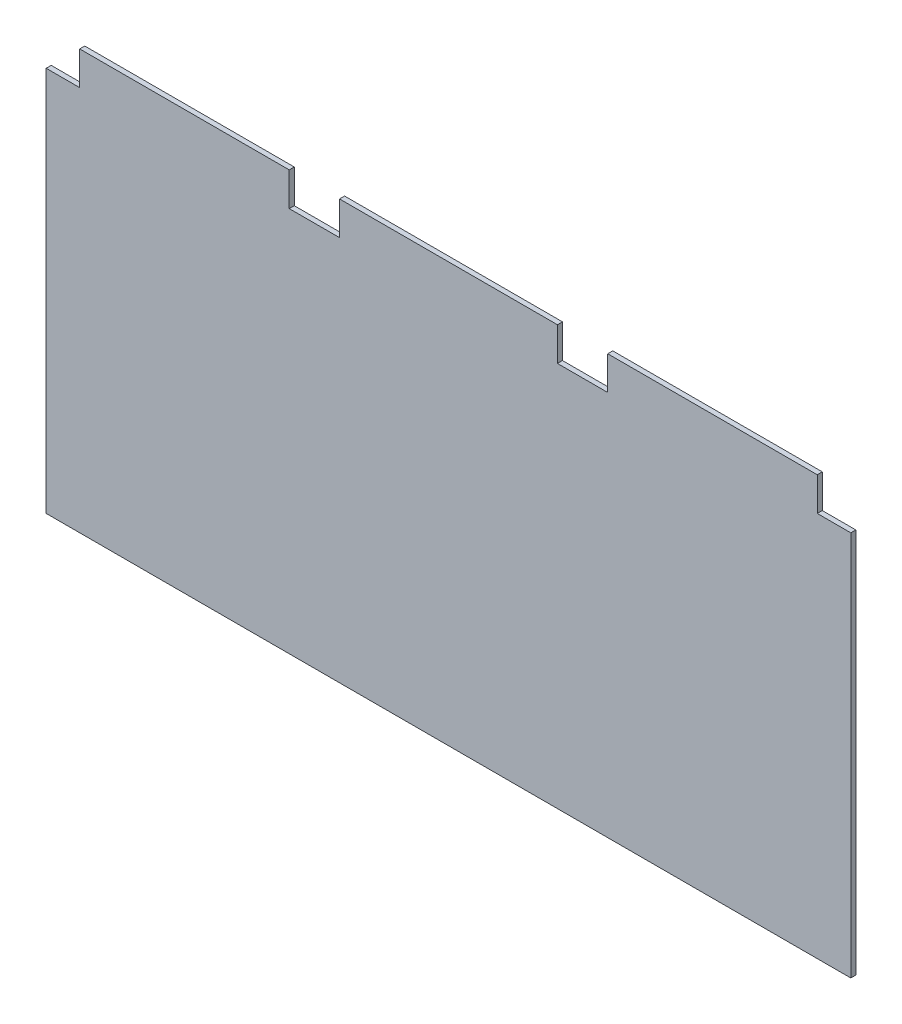
ISO-10303-21;
HEADER;
FILE_DESCRIPTION(('STEP AP214'),'2;1');
FILE_NAME('part.step','',(''),(''),'','','');
FILE_SCHEMA(('AUTOMOTIVE_DESIGN { 1 0 10303 214 1 1 1 1 }'));
ENDSEC;
DATA;
#1=APPLICATION_CONTEXT('core data for automotive mechanical design processes');
#2=APPLICATION_PROTOCOL_DEFINITION('international standard','automotive_design',2000,#1);
#3=PRODUCT_CONTEXT('',#1,'mechanical');
#4=PRODUCT('Part','Part','',(#3));
#5=PRODUCT_RELATED_PRODUCT_CATEGORY('part','',(#4));
#6=PRODUCT_DEFINITION_FORMATION('','',#4);
#7=PRODUCT_DEFINITION_CONTEXT('part definition',#1,'design');
#8=PRODUCT_DEFINITION('design','',#6,#7);
#9=PRODUCT_DEFINITION_SHAPE('','',#8);
#10=(LENGTH_UNIT() NAMED_UNIT(*) SI_UNIT(.MILLI.,.METRE.));
#11=(NAMED_UNIT(*) PLANE_ANGLE_UNIT() SI_UNIT($,.RADIAN.));
#12=(NAMED_UNIT(*) SI_UNIT($,.STERADIAN.) SOLID_ANGLE_UNIT());
#13=UNCERTAINTY_MEASURE_WITH_UNIT(LENGTH_MEASURE(1.E-05),#10,'distance_accuracy_value','');
#14=(GEOMETRIC_REPRESENTATION_CONTEXT(3) GLOBAL_UNCERTAINTY_ASSIGNED_CONTEXT((#13)) GLOBAL_UNIT_ASSIGNED_CONTEXT((#10,
#11,#12)) REPRESENTATION_CONTEXT('',''));
#15=CARTESIAN_POINT('',(0.,0.,0.));
#16=DIRECTION('',(0.,0.,1.));
#17=DIRECTION('',(1.,0.,0.));
#18=AXIS2_PLACEMENT_3D('',#15,#16,#17);
#19=CARTESIAN_POINT('',(0.,0.,3.));
#20=DIRECTION('',(0.,0.,1.));
#21=DIRECTION('',(1.,0.,0.));
#22=AXIS2_PLACEMENT_3D('',#19,#20,#21);
#23=PLANE('',#22);
#24=DIRECTION('',(1.,0.,0.));
#25=VECTOR('',#24,1.);
#26=CARTESIAN_POINT('',(-250.,-130.,3.));
#27=LINE('',#26,#25);
#28=CARTESIAN_POINT('',(-240.,-130.,3.));
#29=VERTEX_POINT('',#28);
#30=CARTESIAN_POINT('',(240.,-130.,3.));
#31=VERTEX_POINT('',#30);
#32=EDGE_CURVE('E164',#29,#31,#27,.T.);
#33=ORIENTED_EDGE('',*,*,#32,.T.);
#34=DIRECTION('',(0.,1.,0.));
#35=VECTOR('',#34,1.);
#36=CARTESIAN_POINT('',(240.,119.999999999998,3.));
#37=LINE('',#36,#35);
#38=CARTESIAN_POINT('',(240.,100.,3.));
#39=VERTEX_POINT('',#38);
#40=EDGE_CURVE('E146',#31,#39,#37,.T.);
#41=ORIENTED_EDGE('',*,*,#40,.T.);
#42=DIRECTION('',(-1.,0.,0.));
#43=VECTOR('',#42,1.);
#44=CARTESIAN_POINT('',(250.,100.,3.));
#45=LINE('',#44,#43);
#46=CARTESIAN_POINT('',(220.,100.,3.));
#47=VERTEX_POINT('',#46);
#48=EDGE_CURVE('E228',#39,#47,#45,.T.);
#49=ORIENTED_EDGE('',*,*,#48,.T.);
#50=DIRECTION('',(0.,1.,0.));
#51=VECTOR('',#50,1.);
#52=CARTESIAN_POINT('',(220.,130.,3.));
#53=LINE('',#52,#51);
#54=CARTESIAN_POINT('',(220.,119.999999999998,3.));
#55=VERTEX_POINT('',#54);
#56=EDGE_CURVE('E231',#47,#55,#53,.T.);
#57=ORIENTED_EDGE('',*,*,#56,.T.);
#58=DIRECTION('',(-1.,0.,0.));
#59=VECTOR('',#58,1.);
#60=CARTESIAN_POINT('',(0.,119.999999999998,3.));
#61=LINE('',#60,#59);
#62=CARTESIAN_POINT('',(95.,119.999999999998,3.));
#63=VERTEX_POINT('',#62);
#64=EDGE_CURVE('E277',#55,#63,#61,.T.);
#65=ORIENTED_EDGE('',*,*,#64,.T.);
#66=DIRECTION('',(0.,-1.,0.));
#67=VECTOR('',#66,1.);
#68=CARTESIAN_POINT('',(95.,130.,3.));
#69=LINE('',#68,#67);
#70=CARTESIAN_POINT('',(95.,100.,3.));
#71=VERTEX_POINT('',#70);
#72=EDGE_CURVE('E227',#63,#71,#69,.T.);
#73=ORIENTED_EDGE('',*,*,#72,.T.);
#74=DIRECTION('',(-1.,0.,0.));
#75=VECTOR('',#74,1.);
#76=CARTESIAN_POINT('',(95.,100.,3.));
#77=LINE('',#76,#75);
#78=CARTESIAN_POINT('',(65.,100.,3.));
#79=VERTEX_POINT('',#78);
#80=EDGE_CURVE('E240',#71,#79,#77,.T.);
#81=ORIENTED_EDGE('',*,*,#80,.T.);
#82=DIRECTION('',(0.,1.,0.));
#83=VECTOR('',#82,1.);
#84=CARTESIAN_POINT('',(65.,130.,3.));
#85=LINE('',#84,#83);
#86=CARTESIAN_POINT('',(65.,119.999999999998,3.));
#87=VERTEX_POINT('',#86);
#88=EDGE_CURVE('E244',#79,#87,#85,.T.);
#89=ORIENTED_EDGE('',*,*,#88,.T.);
#90=DIRECTION('',(1.,0.,0.));
#91=VECTOR('',#90,1.);
#92=CARTESIAN_POINT('',(0.,119.999999999998,3.));
#93=LINE('',#92,#91);
#94=CARTESIAN_POINT('',(-65.,119.999999999998,3.));
#95=VERTEX_POINT('',#94);
#96=EDGE_CURVE('E261',#95,#87,#93,.T.);
#97=ORIENTED_EDGE('',*,*,#96,.F.);
#98=DIRECTION('',(0.,1.,0.));
#99=VECTOR('',#98,1.);
#100=CARTESIAN_POINT('',(-65.,130.,3.));
#101=LINE('',#100,#99);
#102=CARTESIAN_POINT('',(-65.,100.,3.));
#103=VERTEX_POINT('',#102);
#104=EDGE_CURVE('E212',#103,#95,#101,.T.);
#105=ORIENTED_EDGE('',*,*,#104,.F.);
#106=DIRECTION('',(1.,0.,0.));
#107=VECTOR('',#106,1.);
#108=CARTESIAN_POINT('',(-95.,100.,3.));
#109=LINE('',#108,#107);
#110=CARTESIAN_POINT('',(-95.,100.,3.));
#111=VERTEX_POINT('',#110);
#112=EDGE_CURVE('E204',#111,#103,#109,.T.);
#113=ORIENTED_EDGE('',*,*,#112,.F.);
#114=DIRECTION('',(0.,-1.,0.));
#115=VECTOR('',#114,1.);
#116=CARTESIAN_POINT('',(-95.,130.,3.));
#117=LINE('',#116,#115);
#118=CARTESIAN_POINT('',(-95.,119.999999999998,3.));
#119=VERTEX_POINT('',#118);
#120=EDGE_CURVE('E201',#119,#111,#117,.T.);
#121=ORIENTED_EDGE('',*,*,#120,.F.);
#122=CARTESIAN_POINT('',(-220.,119.999999999998,3.));
#123=VERTEX_POINT('',#122);
#124=EDGE_CURVE('E263',#123,#119,#93,.T.);
#125=ORIENTED_EDGE('',*,*,#124,.F.);
#126=DIRECTION('',(0.,1.,0.));
#127=VECTOR('',#126,1.);
#128=CARTESIAN_POINT('',(-220.,130.,3.));
#129=LINE('',#128,#127);
#130=CARTESIAN_POINT('',(-220.,100.,3.));
#131=VERTEX_POINT('',#130);
#132=EDGE_CURVE('E190',#131,#123,#129,.T.);
#133=ORIENTED_EDGE('',*,*,#132,.F.);
#134=DIRECTION('',(1.,0.,0.));
#135=VECTOR('',#134,1.);
#136=CARTESIAN_POINT('',(-250.,100.,3.));
#137=LINE('',#136,#135);
#138=CARTESIAN_POINT('',(-240.,100.,3.));
#139=VERTEX_POINT('',#138);
#140=EDGE_CURVE('E180',#139,#131,#137,.T.);
#141=ORIENTED_EDGE('',*,*,#140,.F.);
#142=DIRECTION('',(0.,1.,0.));
#143=VECTOR('',#142,1.);
#144=CARTESIAN_POINT('',(-240.,119.999999999998,3.));
#145=LINE('',#144,#143);
#146=EDGE_CURVE('E187',#29,#139,#145,.T.);
#147=ORIENTED_EDGE('',*,*,#146,.F.);
#148=EDGE_LOOP('',(#33,#41,#49,#57,#65,#73,#81,#89,#97,#105,#113,#121,#125,#133,#141,#147));
#149=FACE_BOUND('',#148,.T.);
#150=ADVANCED_FACE('F33',(#149),#23,.T.);
#151=CARTESIAN_POINT('',(0.,0.,0.));
#152=DIRECTION('',(0.,0.,1.));
#153=DIRECTION('',(1.,0.,0.));
#154=AXIS2_PLACEMENT_3D('',#151,#152,#153);
#155=PLANE('',#154);
#156=DIRECTION('',(0.,1.,0.));
#157=VECTOR('',#156,1.);
#158=CARTESIAN_POINT('',(240.,119.999999999998,0.));
#159=LINE('',#158,#157);
#160=CARTESIAN_POINT('',(240.,-130.,0.));
#161=VERTEX_POINT('',#160);
#162=CARTESIAN_POINT('',(240.,100.,0.));
#163=VERTEX_POINT('',#162);
#164=EDGE_CURVE('E48',#161,#163,#159,.T.);
#165=ORIENTED_EDGE('',*,*,#164,.F.);
#166=DIRECTION('',(1.,0.,0.));
#167=VECTOR('',#166,1.);
#168=CARTESIAN_POINT('',(-250.,-130.,0.));
#169=LINE('',#168,#167);
#170=CARTESIAN_POINT('',(-240.,-130.,0.));
#171=VERTEX_POINT('',#170);
#172=EDGE_CURVE('E158',#171,#161,#169,.T.);
#173=ORIENTED_EDGE('',*,*,#172,.F.);
#174=DIRECTION('',(0.,1.,0.));
#175=VECTOR('',#174,1.);
#176=CARTESIAN_POINT('',(-240.,119.999999999998,0.));
#177=LINE('',#176,#175);
#178=CARTESIAN_POINT('',(-240.,100.,0.));
#179=VERTEX_POINT('',#178);
#180=EDGE_CURVE('E268',#171,#179,#177,.T.);
#181=ORIENTED_EDGE('',*,*,#180,.T.);
#182=DIRECTION('',(1.,0.,0.));
#183=VECTOR('',#182,1.);
#184=CARTESIAN_POINT('',(-250.,100.,0.));
#185=LINE('',#184,#183);
#186=CARTESIAN_POINT('',(-220.,100.,0.));
#187=VERTEX_POINT('',#186);
#188=EDGE_CURVE('E182',#179,#187,#185,.T.);
#189=ORIENTED_EDGE('',*,*,#188,.T.);
#190=DIRECTION('',(0.,1.,0.));
#191=VECTOR('',#190,1.);
#192=CARTESIAN_POINT('',(-220.,130.,0.));
#193=LINE('',#192,#191);
#194=CARTESIAN_POINT('',(-220.,119.999999999998,0.));
#195=VERTEX_POINT('',#194);
#196=EDGE_CURVE('E198',#187,#195,#193,.T.);
#197=ORIENTED_EDGE('',*,*,#196,.T.);
#198=DIRECTION('',(1.,0.,0.));
#199=VECTOR('',#198,1.);
#200=CARTESIAN_POINT('',(0.,119.999999999998,0.));
#201=LINE('',#200,#199);
#202=CARTESIAN_POINT('',(-95.,119.999999999998,0.));
#203=VERTEX_POINT('',#202);
#204=EDGE_CURVE('E260',#195,#203,#201,.T.);
#205=ORIENTED_EDGE('',*,*,#204,.T.);
#206=DIRECTION('',(0.,-1.,0.));
#207=VECTOR('',#206,1.);
#208=CARTESIAN_POINT('',(-95.,130.,0.));
#209=LINE('',#208,#207);
#210=CARTESIAN_POINT('',(-95.,100.,0.));
#211=VERTEX_POINT('',#210);
#212=EDGE_CURVE('E215',#203,#211,#209,.T.);
#213=ORIENTED_EDGE('',*,*,#212,.T.);
#214=DIRECTION('',(1.,0.,0.));
#215=VECTOR('',#214,1.);
#216=CARTESIAN_POINT('',(-95.,100.,0.));
#217=LINE('',#216,#215);
#218=CARTESIAN_POINT('',(-65.,100.,0.));
#219=VERTEX_POINT('',#218);
#220=EDGE_CURVE('E220',#211,#219,#217,.T.);
#221=ORIENTED_EDGE('',*,*,#220,.T.);
#222=DIRECTION('',(0.,1.,0.));
#223=VECTOR('',#222,1.);
#224=CARTESIAN_POINT('',(-65.,130.,0.));
#225=LINE('',#224,#223);
#226=CARTESIAN_POINT('',(-65.,119.999999999998,0.));
#227=VERTEX_POINT('',#226);
#228=EDGE_CURVE('E210',#219,#227,#225,.T.);
#229=ORIENTED_EDGE('',*,*,#228,.T.);
#230=CARTESIAN_POINT('',(65.,119.999999999998,0.));
#231=VERTEX_POINT('',#230);
#232=EDGE_CURVE('E266',#227,#231,#201,.T.);
#233=ORIENTED_EDGE('',*,*,#232,.T.);
#234=DIRECTION('',(0.,1.,0.));
#235=VECTOR('',#234,1.);
#236=CARTESIAN_POINT('',(65.,130.,0.));
#237=LINE('',#236,#235);
#238=CARTESIAN_POINT('',(65.,100.,0.));
#239=VERTEX_POINT('',#238);
#240=EDGE_CURVE('E250',#239,#231,#237,.T.);
#241=ORIENTED_EDGE('',*,*,#240,.F.);
#242=DIRECTION('',(-1.,0.,0.));
#243=VECTOR('',#242,1.);
#244=CARTESIAN_POINT('',(95.,100.,0.));
#245=LINE('',#244,#243);
#246=CARTESIAN_POINT('',(95.,100.,0.));
#247=VERTEX_POINT('',#246);
#248=EDGE_CURVE('E238',#247,#239,#245,.T.);
#249=ORIENTED_EDGE('',*,*,#248,.F.);
#250=DIRECTION('',(0.,-1.,0.));
#251=VECTOR('',#250,1.);
#252=CARTESIAN_POINT('',(95.,130.,0.));
#253=LINE('',#252,#251);
#254=CARTESIAN_POINT('',(95.,119.999999999998,0.));
#255=VERTEX_POINT('',#254);
#256=EDGE_CURVE('E243',#255,#247,#253,.T.);
#257=ORIENTED_EDGE('',*,*,#256,.F.);
#258=DIRECTION('',(-1.,0.,0.));
#259=VECTOR('',#258,1.);
#260=CARTESIAN_POINT('',(0.,119.999999999998,0.));
#261=LINE('',#260,#259);
#262=CARTESIAN_POINT('',(220.,119.999999999998,0.));
#263=VERTEX_POINT('',#262);
#264=EDGE_CURVE('E55',#263,#255,#261,.T.);
#265=ORIENTED_EDGE('',*,*,#264,.F.);
#266=DIRECTION('',(0.,1.,0.));
#267=VECTOR('',#266,1.);
#268=CARTESIAN_POINT('',(220.,130.,0.));
#269=LINE('',#268,#267);
#270=CARTESIAN_POINT('',(220.,100.,0.));
#271=VERTEX_POINT('',#270);
#272=EDGE_CURVE('E230',#271,#263,#269,.T.);
#273=ORIENTED_EDGE('',*,*,#272,.F.);
#274=DIRECTION('',(-1.,0.,0.));
#275=VECTOR('',#274,1.);
#276=CARTESIAN_POINT('',(250.,100.,0.));
#277=LINE('',#276,#275);
#278=EDGE_CURVE('E160',#163,#271,#277,.T.);
#279=ORIENTED_EDGE('',*,*,#278,.F.);
#280=EDGE_LOOP('',(#165,#173,#181,#189,#197,#205,#213,#221,#229,#233,#241,#249,#257,#265,#273,#279));
#281=FACE_BOUND('',#280,.T.);
#282=ADVANCED_FACE('F156',(#281),#155,.F.);
#283=CARTESIAN_POINT('',(-250.,-130.,3.));
#284=DIRECTION('',(0.,1.,0.));
#285=DIRECTION('',(0.,0.,1.));
#286=AXIS2_PLACEMENT_3D('',#283,#284,#285);
#287=PLANE('',#286);
#288=DIRECTION('',(0.,0.,1.));
#289=VECTOR('',#288,1.);
#290=CARTESIAN_POINT('',(240.,-130.,0.));
#291=LINE('',#290,#289);
#292=EDGE_CURVE('E143',#161,#31,#291,.T.);
#293=ORIENTED_EDGE('',*,*,#292,.T.);
#294=ORIENTED_EDGE('',*,*,#32,.F.);
#295=DIRECTION('',(0.,0.,1.));
#296=VECTOR('',#295,1.);
#297=CARTESIAN_POINT('',(-240.,-130.,0.));
#298=LINE('',#297,#296);
#299=EDGE_CURVE('E163',#171,#29,#298,.T.);
#300=ORIENTED_EDGE('',*,*,#299,.F.);
#301=ORIENTED_EDGE('',*,*,#172,.T.);
#302=EDGE_LOOP('',(#293,#294,#300,#301));
#303=FACE_BOUND('',#302,.T.);
#304=ADVANCED_FACE('F35',(#303),#287,.F.);
#305=CARTESIAN_POINT('',(250.,100.,0.));
#306=DIRECTION('',(0.,1.,0.));
#307=DIRECTION('',(0.,0.,1.));
#308=AXIS2_PLACEMENT_3D('',#305,#306,#307);
#309=PLANE('',#308);
#310=ORIENTED_EDGE('',*,*,#48,.F.);
#311=DIRECTION('',(0.,0.,-1.));
#312=VECTOR('',#311,1.);
#313=CARTESIAN_POINT('',(240.,100.,0.));
#314=LINE('',#313,#312);
#315=EDGE_CURVE('E11',#39,#163,#314,.T.);
#316=ORIENTED_EDGE('',*,*,#315,.T.);
#317=ORIENTED_EDGE('',*,*,#278,.T.);
#318=DIRECTION('',(0.,0.,1.));
#319=VECTOR('',#318,1.);
#320=CARTESIAN_POINT('',(220.,100.,0.));
#321=LINE('',#320,#319);
#322=EDGE_CURVE('E224',#271,#47,#321,.T.);
#323=ORIENTED_EDGE('',*,*,#322,.T.);
#324=EDGE_LOOP('',(#310,#316,#317,#323));
#325=FACE_BOUND('',#324,.T.);
#326=ADVANCED_FACE('F330',(#325),#309,.T.);
#327=CARTESIAN_POINT('',(220.,130.,0.));
#328=DIRECTION('',(1.,0.,0.));
#329=DIRECTION('',(0.,0.,-1.));
#330=AXIS2_PLACEMENT_3D('',#327,#328,#329);
#331=PLANE('',#330);
#332=ORIENTED_EDGE('',*,*,#272,.T.);
#333=DIRECTION('',(0.,0.,1.));
#334=VECTOR('',#333,1.);
#335=CARTESIAN_POINT('',(220.,119.999999999998,0.));
#336=LINE('',#335,#334);
#337=EDGE_CURVE('E265',#263,#55,#336,.T.);
#338=ORIENTED_EDGE('',*,*,#337,.T.);
#339=ORIENTED_EDGE('',*,*,#56,.F.);
#340=ORIENTED_EDGE('',*,*,#322,.F.);
#341=EDGE_LOOP('',(#332,#338,#339,#340));
#342=FACE_BOUND('',#341,.T.);
#343=ADVANCED_FACE('F334',(#342),#331,.T.);
#344=CARTESIAN_POINT('',(95.,130.,0.));
#345=DIRECTION('',(-1.,0.,0.));
#346=DIRECTION('',(0.,0.,1.));
#347=AXIS2_PLACEMENT_3D('',#344,#345,#346);
#348=PLANE('',#347);
#349=ORIENTED_EDGE('',*,*,#72,.F.);
#350=DIRECTION('',(0.,0.,-1.));
#351=VECTOR('',#350,1.);
#352=CARTESIAN_POINT('',(95.,119.999999999998,0.));
#353=LINE('',#352,#351);
#354=EDGE_CURVE('E272',#63,#255,#353,.T.);
#355=ORIENTED_EDGE('',*,*,#354,.T.);
#356=ORIENTED_EDGE('',*,*,#256,.T.);
#357=DIRECTION('',(0.,0.,1.));
#358=VECTOR('',#357,1.);
#359=CARTESIAN_POINT('',(95.,100.,0.));
#360=LINE('',#359,#358);
#361=EDGE_CURVE('E191',#247,#71,#360,.T.);
#362=ORIENTED_EDGE('',*,*,#361,.T.);
#363=EDGE_LOOP('',(#349,#355,#356,#362));
#364=FACE_BOUND('',#363,.T.);
#365=ADVANCED_FACE('F284',(#364),#348,.T.);
#366=CARTESIAN_POINT('',(65.,130.,0.));
#367=DIRECTION('',(1.,0.,0.));
#368=DIRECTION('',(0.,0.,-1.));
#369=AXIS2_PLACEMENT_3D('',#366,#367,#368);
#370=PLANE('',#369);
#371=ORIENTED_EDGE('',*,*,#240,.T.);
#372=DIRECTION('',(0.,0.,1.));
#373=VECTOR('',#372,1.);
#374=CARTESIAN_POINT('',(65.,119.999999999998,0.));
#375=LINE('',#374,#373);
#376=EDGE_CURVE('E151',#231,#87,#375,.T.);
#377=ORIENTED_EDGE('',*,*,#376,.T.);
#378=ORIENTED_EDGE('',*,*,#88,.F.);
#379=DIRECTION('',(0.,0.,1.));
#380=VECTOR('',#379,1.);
#381=CARTESIAN_POINT('',(65.,100.,0.));
#382=LINE('',#381,#380);
#383=EDGE_CURVE('E195',#239,#79,#382,.T.);
#384=ORIENTED_EDGE('',*,*,#383,.F.);
#385=EDGE_LOOP('',(#371,#377,#378,#384));
#386=FACE_BOUND('',#385,.T.);
#387=ADVANCED_FACE('F293',(#386),#370,.T.);
#388=CARTESIAN_POINT('',(-220.,130.,0.));
#389=DIRECTION('',(1.,0.,0.));
#390=DIRECTION('',(0.,0.,-1.));
#391=AXIS2_PLACEMENT_3D('',#388,#389,#390);
#392=PLANE('',#391);
#393=ORIENTED_EDGE('',*,*,#132,.T.);
#394=DIRECTION('',(0.,0.,-1.));
#395=VECTOR('',#394,1.);
#396=CARTESIAN_POINT('',(-220.,119.999999999998,0.));
#397=LINE('',#396,#395);
#398=EDGE_CURVE('E234',#123,#195,#397,.T.);
#399=ORIENTED_EDGE('',*,*,#398,.T.);
#400=ORIENTED_EDGE('',*,*,#196,.F.);
#401=DIRECTION('',(0.,0.,1.));
#402=VECTOR('',#401,1.);
#403=CARTESIAN_POINT('',(-220.,100.,0.));
#404=LINE('',#403,#402);
#405=EDGE_CURVE('E200',#187,#131,#404,.T.);
#406=ORIENTED_EDGE('',*,*,#405,.T.);
#407=EDGE_LOOP('',(#393,#399,#400,#406));
#408=FACE_BOUND('',#407,.T.);
#409=ADVANCED_FACE('F312',(#408),#392,.F.);
#410=CARTESIAN_POINT('',(-250.,100.,0.));
#411=DIRECTION('',(0.,-1.,0.));
#412=DIRECTION('',(0.,0.,-1.));
#413=AXIS2_PLACEMENT_3D('',#410,#411,#412);
#414=PLANE('',#413);
#415=ORIENTED_EDGE('',*,*,#188,.F.);
#416=DIRECTION('',(0.,0.,1.));
#417=VECTOR('',#416,1.);
#418=CARTESIAN_POINT('',(-240.,100.,0.));
#419=LINE('',#418,#417);
#420=EDGE_CURVE('E41',#179,#139,#419,.T.);
#421=ORIENTED_EDGE('',*,*,#420,.T.);
#422=ORIENTED_EDGE('',*,*,#140,.T.);
#423=ORIENTED_EDGE('',*,*,#405,.F.);
#424=EDGE_LOOP('',(#415,#421,#422,#423));
#425=FACE_BOUND('',#424,.T.);
#426=ADVANCED_FACE('F178',(#425),#414,.F.);
#427=CARTESIAN_POINT('',(-95.,130.,0.));
#428=DIRECTION('',(-1.,0.,0.));
#429=DIRECTION('',(0.,0.,1.));
#430=AXIS2_PLACEMENT_3D('',#427,#428,#429);
#431=PLANE('',#430);
#432=ORIENTED_EDGE('',*,*,#212,.F.);
#433=DIRECTION('',(0.,0.,1.));
#434=VECTOR('',#433,1.);
#435=CARTESIAN_POINT('',(-95.,119.999999999998,0.));
#436=LINE('',#435,#434);
#437=EDGE_CURVE('E256',#203,#119,#436,.T.);
#438=ORIENTED_EDGE('',*,*,#437,.T.);
#439=ORIENTED_EDGE('',*,*,#120,.T.);
#440=DIRECTION('',(0.,0.,1.));
#441=VECTOR('',#440,1.);
#442=CARTESIAN_POINT('',(-95.,100.,0.));
#443=LINE('',#442,#441);
#444=EDGE_CURVE('E169',#211,#111,#443,.T.);
#445=ORIENTED_EDGE('',*,*,#444,.F.);
#446=EDGE_LOOP('',(#432,#438,#439,#445));
#447=FACE_BOUND('',#446,.T.);
#448=ADVANCED_FACE('F309',(#447),#431,.F.);
#449=CARTESIAN_POINT('',(-65.,130.,0.));
#450=DIRECTION('',(1.,0.,0.));
#451=DIRECTION('',(0.,0.,-1.));
#452=AXIS2_PLACEMENT_3D('',#449,#450,#451);
#453=PLANE('',#452);
#454=ORIENTED_EDGE('',*,*,#104,.T.);
#455=DIRECTION('',(0.,0.,-1.));
#456=VECTOR('',#455,1.);
#457=CARTESIAN_POINT('',(-65.,119.999999999998,0.));
#458=LINE('',#457,#456);
#459=EDGE_CURVE('E167',#95,#227,#458,.T.);
#460=ORIENTED_EDGE('',*,*,#459,.T.);
#461=ORIENTED_EDGE('',*,*,#228,.F.);
#462=DIRECTION('',(0.,0.,1.));
#463=VECTOR('',#462,1.);
#464=CARTESIAN_POINT('',(-65.,100.,0.));
#465=LINE('',#464,#463);
#466=EDGE_CURVE('E165',#219,#103,#465,.T.);
#467=ORIENTED_EDGE('',*,*,#466,.T.);
#468=EDGE_LOOP('',(#454,#460,#461,#467));
#469=FACE_BOUND('',#468,.T.);
#470=ADVANCED_FACE('F300',(#469),#453,.F.);
#471=CARTESIAN_POINT('',(-95.,100.,0.));
#472=DIRECTION('',(0.,-1.,0.));
#473=DIRECTION('',(0.,0.,-1.));
#474=AXIS2_PLACEMENT_3D('',#471,#472,#473);
#475=PLANE('',#474);
#476=ORIENTED_EDGE('',*,*,#112,.T.);
#477=ORIENTED_EDGE('',*,*,#466,.F.);
#478=ORIENTED_EDGE('',*,*,#220,.F.);
#479=ORIENTED_EDGE('',*,*,#444,.T.);
#480=EDGE_LOOP('',(#476,#477,#478,#479));
#481=FACE_BOUND('',#480,.T.);
#482=ADVANCED_FACE('F304',(#481),#475,.F.);
#483=CARTESIAN_POINT('',(95.,100.,0.));
#484=DIRECTION('',(0.,1.,0.));
#485=DIRECTION('',(0.,0.,1.));
#486=AXIS2_PLACEMENT_3D('',#483,#484,#485);
#487=PLANE('',#486);
#488=ORIENTED_EDGE('',*,*,#80,.F.);
#489=ORIENTED_EDGE('',*,*,#361,.F.);
#490=ORIENTED_EDGE('',*,*,#248,.T.);
#491=ORIENTED_EDGE('',*,*,#383,.T.);
#492=EDGE_LOOP('',(#488,#489,#490,#491));
#493=FACE_BOUND('',#492,.T.);
#494=ADVANCED_FACE('F289',(#493),#487,.T.);
#495=CARTESIAN_POINT('',(0.,119.999999999998,0.));
#496=DIRECTION('',(0.,-1.,0.));
#497=DIRECTION('',(1.,0.,0.));
#498=AXIS2_PLACEMENT_3D('',#495,#496,#497);
#499=PLANE('',#498);
#500=ORIENTED_EDGE('',*,*,#96,.T.);
#501=ORIENTED_EDGE('',*,*,#376,.F.);
#502=ORIENTED_EDGE('',*,*,#232,.F.);
#503=ORIENTED_EDGE('',*,*,#459,.F.);
#504=EDGE_LOOP('',(#500,#501,#502,#503));
#505=FACE_BOUND('',#504,.T.);
#506=ADVANCED_FACE('F368',(#505),#499,.F.);
#507=ORIENTED_EDGE('',*,*,#124,.T.);
#508=ORIENTED_EDGE('',*,*,#437,.F.);
#509=ORIENTED_EDGE('',*,*,#204,.F.);
#510=ORIENTED_EDGE('',*,*,#398,.F.);
#511=EDGE_LOOP('',(#507,#508,#509,#510));
#512=FACE_BOUND('',#511,.T.);
#513=ADVANCED_FACE('F311',(#512),#499,.F.);
#514=CARTESIAN_POINT('',(-240.,119.999999999998,0.));
#515=DIRECTION('',(1.,0.,0.));
#516=DIRECTION('',(0.,0.,-1.));
#517=AXIS2_PLACEMENT_3D('',#514,#515,#516);
#518=PLANE('',#517);
#519=ORIENTED_EDGE('',*,*,#180,.F.);
#520=ORIENTED_EDGE('',*,*,#299,.T.);
#521=ORIENTED_EDGE('',*,*,#146,.T.);
#522=ORIENTED_EDGE('',*,*,#420,.F.);
#523=EDGE_LOOP('',(#519,#520,#521,#522));
#524=FACE_BOUND('',#523,.T.);
#525=ADVANCED_FACE('F382',(#524),#518,.F.);
#526=CARTESIAN_POINT('',(0.,119.999999999998,0.));
#527=DIRECTION('',(0.,1.,0.));
#528=DIRECTION('',(-1.,0.,0.));
#529=AXIS2_PLACEMENT_3D('',#526,#527,#528);
#530=PLANE('',#529);
#531=ORIENTED_EDGE('',*,*,#264,.T.);
#532=ORIENTED_EDGE('',*,*,#354,.F.);
#533=ORIENTED_EDGE('',*,*,#64,.F.);
#534=ORIENTED_EDGE('',*,*,#337,.F.);
#535=EDGE_LOOP('',(#531,#532,#533,#534));
#536=FACE_BOUND('',#535,.T.);
#537=ADVANCED_FACE('F388',(#536),#530,.T.);
#538=CARTESIAN_POINT('',(240.,119.999999999998,0.));
#539=DIRECTION('',(1.,0.,0.));
#540=DIRECTION('',(0.,0.,-1.));
#541=AXIS2_PLACEMENT_3D('',#538,#539,#540);
#542=PLANE('',#541);
#543=ORIENTED_EDGE('',*,*,#40,.F.);
#544=ORIENTED_EDGE('',*,*,#292,.F.);
#545=ORIENTED_EDGE('',*,*,#164,.T.);
#546=ORIENTED_EDGE('',*,*,#315,.F.);
#547=EDGE_LOOP('',(#543,#544,#545,#546));
#548=FACE_BOUND('',#547,.T.);
#549=ADVANCED_FACE('F144',(#548),#542,.T.);
#550=CLOSED_SHELL('',(#150,#282,#304,#326,#343,#365,#387,#409,#426,#448,#470,#482,#494,#506,
#513,#525,#537,#549));
#551=MANIFOLD_SOLID_BREP('B2',#550);
#552=ADVANCED_BREP_SHAPE_REPRESENTATION('',(#18,#551),#14);
#553=SHAPE_DEFINITION_REPRESENTATION(#9,#552);
ENDSEC;
END-ISO-10303-21;
